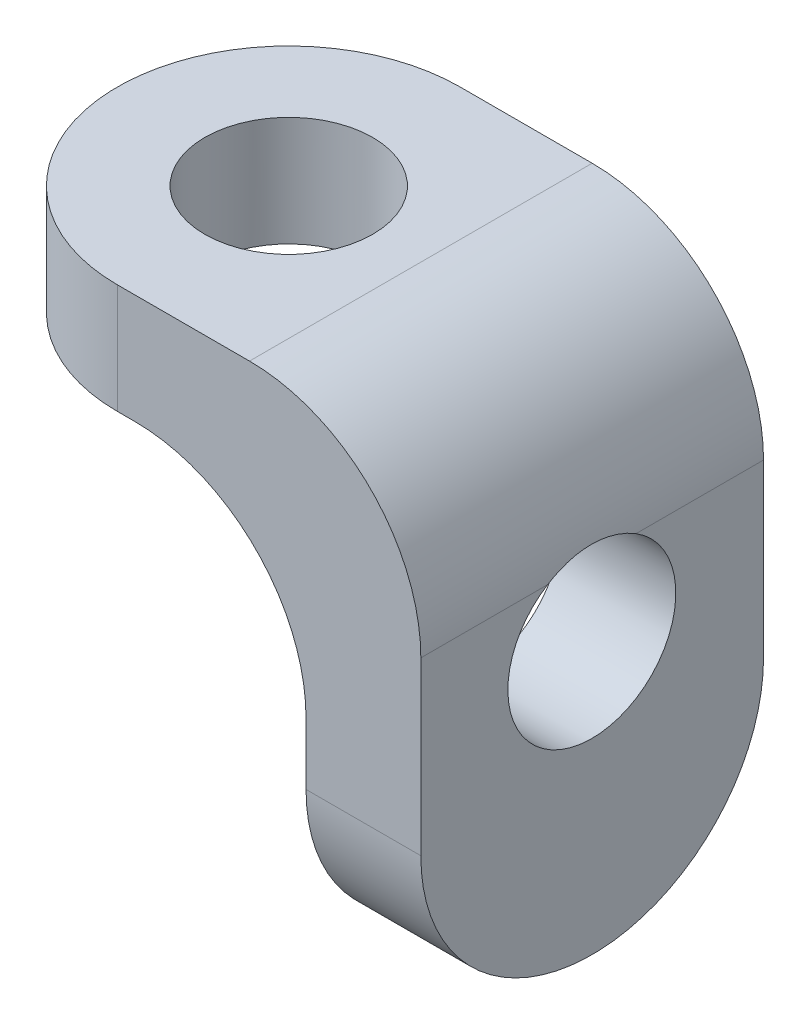
ISO-10303-21;
HEADER;
FILE_DESCRIPTION(('STEP AP214'),'2;1');
FILE_NAME('part.step','',(''),(''),'','','');
FILE_SCHEMA(('AUTOMOTIVE_DESIGN { 1 0 10303 214 1 1 1 1 }'));
ENDSEC;
DATA;
#1=APPLICATION_CONTEXT('core data for automotive mechanical design processes');
#2=APPLICATION_PROTOCOL_DEFINITION('international standard','automotive_design',2000,#1);
#3=PRODUCT_CONTEXT('',#1,'mechanical');
#4=PRODUCT('Part','Part','',(#3));
#5=PRODUCT_RELATED_PRODUCT_CATEGORY('part','',(#4));
#6=PRODUCT_DEFINITION_FORMATION('','',#4);
#7=PRODUCT_DEFINITION_CONTEXT('part definition',#1,'design');
#8=PRODUCT_DEFINITION('design','',#6,#7);
#9=PRODUCT_DEFINITION_SHAPE('','',#8);
#10=(LENGTH_UNIT() NAMED_UNIT(*) SI_UNIT(.MILLI.,.METRE.));
#11=(NAMED_UNIT(*) PLANE_ANGLE_UNIT() SI_UNIT($,.RADIAN.));
#12=(NAMED_UNIT(*) SI_UNIT($,.STERADIAN.) SOLID_ANGLE_UNIT());
#13=UNCERTAINTY_MEASURE_WITH_UNIT(LENGTH_MEASURE(1.E-05),#10,'distance_accuracy_value','');
#14=(GEOMETRIC_REPRESENTATION_CONTEXT(3) GLOBAL_UNCERTAINTY_ASSIGNED_CONTEXT((#13)) GLOBAL_UNIT_ASSIGNED_CONTEXT((#10,
#11,#12)) REPRESENTATION_CONTEXT('',''));
#15=CARTESIAN_POINT('',(0.,0.,0.));
#16=DIRECTION('',(0.,0.,1.));
#17=DIRECTION('',(1.,0.,0.));
#18=AXIS2_PLACEMENT_3D('',#15,#16,#17);
#19=CARTESIAN_POINT('',(158.280994049728,78.346819106948,-66.7483953836197));
#20=DIRECTION('',(0.,-1.,0.));
#21=DIRECTION('',(0.,0.,1.));
#22=AXIS2_PLACEMENT_3D('',#19,#20,#21);
#23=PLANE('',#22);
#24=DIRECTION('',(-1.,0.,0.));
#25=VECTOR('',#24,1.);
#26=CARTESIAN_POINT('',(158.280994049728,78.346819106948,-71.7483953836197));
#27=LINE('',#26,#25);
#28=CARTESIAN_POINT('',(158.786005082726,78.346819106948,-71.7483953836197));
#29=VERTEX_POINT('',#28);
#30=CARTESIAN_POINT('',(158.280994049728,78.346819106948,-71.7483953836197));
#31=VERTEX_POINT('',#30);
#32=EDGE_CURVE('E11',#29,#31,#27,.T.);
#33=ORIENTED_EDGE('',*,*,#32,.F.);
#34=DIRECTION('',(0.,0.,-1.));
#35=VECTOR('',#34,1.);
#36=CARTESIAN_POINT('',(158.786005082726,78.346819106948,-61.7483953836197));
#37=LINE('',#36,#35);
#38=CARTESIAN_POINT('',(158.786005082726,78.346819106948,-69.145782264486));
#39=VERTEX_POINT('',#38);
#40=EDGE_CURVE('E24',#29,#39,#37,.F.);
#41=ORIENTED_EDGE('',*,*,#40,.T.);
#42=CARTESIAN_POINT('',(158.280994049728,78.346819106948,-66.7483953836197));
#43=DIRECTION('',(0.,-1.,0.));
#44=DIRECTION('',(0.,0.,-1.));
#45=AXIS2_PLACEMENT_3D('',#42,#43,#44);
#46=CIRCLE('',#45,2.45);
#47=CARTESIAN_POINT('',(158.786005082726,78.346819106948,-64.3510085027534));
#48=VERTEX_POINT('',#47);
#49=EDGE_CURVE('E230',#48,#39,#46,.T.);
#50=ORIENTED_EDGE('',*,*,#49,.F.);
#51=DIRECTION('',(0.,0.,-1.));
#52=VECTOR('',#51,1.);
#53=CARTESIAN_POINT('',(158.786005082726,78.346819106948,-61.7483953836197));
#54=LINE('',#53,#52);
#55=CARTESIAN_POINT('',(158.786005082726,78.346819106948,-61.7483953836197));
#56=VERTEX_POINT('',#55);
#57=EDGE_CURVE('E228',#48,#56,#54,.F.);
#58=ORIENTED_EDGE('',*,*,#57,.T.);
#59=DIRECTION('',(-1.,0.,0.));
#60=VECTOR('',#59,1.);
#61=CARTESIAN_POINT('',(158.280994049728,78.346819106948,-61.7483953836197));
#62=LINE('',#61,#60);
#63=CARTESIAN_POINT('',(158.280994049728,78.346819106948,-61.7483953836197));
#64=VERTEX_POINT('',#63);
#65=EDGE_CURVE('E225',#56,#64,#62,.T.);
#66=ORIENTED_EDGE('',*,*,#65,.T.);
#67=CARTESIAN_POINT('',(158.280994049728,78.346819106948,-66.7483953836197));
#68=DIRECTION('',(0.,-1.,0.));
#69=DIRECTION('',(0.,0.,-1.));
#70=AXIS2_PLACEMENT_3D('',#67,#68,#69);
#71=CIRCLE('',#70,5.);
#72=EDGE_CURVE('E202',#64,#31,#71,.T.);
#73=ORIENTED_EDGE('',*,*,#72,.T.);
#74=EDGE_LOOP('',(#33,#41,#50,#58,#66,#73));
#75=FACE_BOUND('',#74,.T.);
#76=ADVANCED_FACE('F16',(#75),#23,.T.);
#77=CARTESIAN_POINT('',(167.136005082726,78.344819106948,-66.7483953836197));
#78=DIRECTION('',(1.,0.,0.));
#79=DIRECTION('',(0.,0.,-1.));
#80=AXIS2_PLACEMENT_3D('',#77,#78,#79);
#81=PLANE('',#80);
#82=DIRECTION('',(0.,1.,0.));
#83=VECTOR('',#82,1.);
#84=CARTESIAN_POINT('',(167.136005082726,78.344819106948,-71.7483953836197));
#85=LINE('',#84,#83);
#86=CARTESIAN_POINT('',(167.136005082726,71.546819106948,-71.7483953836197));
#87=VERTEX_POINT('',#86);
#88=CARTESIAN_POINT('',(167.136005082726,76.546819106948,-71.7483953836197));
#89=VERTEX_POINT('',#88);
#90=EDGE_CURVE('E193',#87,#89,#85,.T.);
#91=ORIENTED_EDGE('',*,*,#90,.T.);
#92=DIRECTION('',(0.,0.,-1.));
#93=VECTOR('',#92,1.);
#94=CARTESIAN_POINT('',(167.136005082726,76.546819106948,-61.7483953836197));
#95=LINE('',#94,#93);
#96=CARTESIAN_POINT('',(167.136005082726,76.546819106948,-68.0270752663484));
#97=VERTEX_POINT('',#96);
#98=EDGE_CURVE('E195',#89,#97,#95,.F.);
#99=ORIENTED_EDGE('',*,*,#98,.T.);
#100=CARTESIAN_POINT('',(167.136005082726,74.463418214921,-66.7379124670476));
#101=DIRECTION('',(1.,0.,0.));
#102=DIRECTION('',(0.,0.,-1.));
#103=AXIS2_PLACEMENT_3D('',#100,#101,#102);
#104=CIRCLE('',#103,2.45);
#105=CARTESIAN_POINT('',(167.136005082726,76.546819106948,-65.4487496677468));
#106=VERTEX_POINT('',#105);
#107=EDGE_CURVE('E215',#106,#97,#104,.T.);
#108=ORIENTED_EDGE('',*,*,#107,.F.);
#109=DIRECTION('',(0.,0.,-1.));
#110=VECTOR('',#109,1.);
#111=CARTESIAN_POINT('',(167.136005082726,76.546819106948,-61.7483953836197));
#112=LINE('',#111,#110);
#113=CARTESIAN_POINT('',(167.136005082726,76.546819106948,-61.7483953836197));
#114=VERTEX_POINT('',#113);
#115=EDGE_CURVE('E219',#106,#114,#112,.F.);
#116=ORIENTED_EDGE('',*,*,#115,.T.);
#117=DIRECTION('',(0.,1.,0.));
#118=VECTOR('',#117,1.);
#119=CARTESIAN_POINT('',(167.136005082726,78.344819106948,-61.7483953836197));
#120=LINE('',#119,#118);
#121=CARTESIAN_POINT('',(167.136005082726,71.546819106948,-61.7483953836197));
#122=VERTEX_POINT('',#121);
#123=EDGE_CURVE('E239',#122,#114,#120,.T.);
#124=ORIENTED_EDGE('',*,*,#123,.F.);
#125=CARTESIAN_POINT('',(167.136005082726,71.546819106948,-66.7483953836197));
#126=DIRECTION('',(1.,0.,0.));
#127=DIRECTION('',(0.,0.,-1.));
#128=AXIS2_PLACEMENT_3D('',#125,#126,#127);
#129=CIRCLE('',#128,5.);
#130=EDGE_CURVE('E198',#122,#87,#129,.T.);
#131=ORIENTED_EDGE('',*,*,#130,.T.);
#132=EDGE_LOOP('',(#91,#99,#108,#116,#124,#131));
#133=FACE_BOUND('',#132,.T.);
#134=ADVANCED_FACE('F185',(#133),#81,.T.);
#135=CARTESIAN_POINT('',(158.483499566228,81.546819106948,-66.7379124670476));
#136=DIRECTION('',(0.,-1.,0.));
#137=DIRECTION('',(1.,0.,0.));
#138=AXIS2_PLACEMENT_3D('',#135,#136,#137);
#139=PLANE('',#138);
#140=DIRECTION('',(-1.,0.,0.));
#141=VECTOR('',#140,1.);
#142=CARTESIAN_POINT('',(158.280994049728,81.546819106948,-61.7483953836197));
#143=LINE('',#142,#141);
#144=CARTESIAN_POINT('',(162.136005082726,81.546819106948,-61.7483953836197));
#145=VERTEX_POINT('',#144);
#146=CARTESIAN_POINT('',(158.280994049728,81.546819106948,-61.7483953836197));
#147=VERTEX_POINT('',#146);
#148=EDGE_CURVE('E244',#145,#147,#143,.T.);
#149=ORIENTED_EDGE('',*,*,#148,.F.);
#150=DIRECTION('',(0.,0.,-1.));
#151=VECTOR('',#150,1.);
#152=CARTESIAN_POINT('',(162.136005082726,81.546819106948,-71.7483953836197));
#153=LINE('',#152,#151);
#154=CARTESIAN_POINT('',(162.136005082726,81.546819106948,-71.7483953836197));
#155=VERTEX_POINT('',#154);
#156=EDGE_CURVE('E243',#145,#155,#153,.T.);
#157=ORIENTED_EDGE('',*,*,#156,.T.);
#158=DIRECTION('',(-1.,0.,0.));
#159=VECTOR('',#158,1.);
#160=CARTESIAN_POINT('',(158.280994049728,81.546819106948,-71.7483953836197));
#161=LINE('',#160,#159);
#162=CARTESIAN_POINT('',(158.280994049728,81.546819106948,-71.7483953836197));
#163=VERTEX_POINT('',#162);
#164=EDGE_CURVE('E207',#155,#163,#161,.T.);
#165=ORIENTED_EDGE('',*,*,#164,.T.);
#166=CARTESIAN_POINT('',(158.280994049728,81.546819106948,-66.7483953836197));
#167=DIRECTION('',(0.,-1.,0.));
#168=DIRECTION('',(0.,0.,-1.));
#169=AXIS2_PLACEMENT_3D('',#166,#167,#168);
#170=CIRCLE('',#169,5.);
#171=EDGE_CURVE('E238',#163,#147,#170,.F.);
#172=ORIENTED_EDGE('',*,*,#171,.T.);
#173=EDGE_LOOP('',(#149,#157,#165,#172));
#174=FACE_BOUND('',#173,.T.);
#175=CARTESIAN_POINT('',(158.280994049728,81.546819106948,-66.7483953836197));
#176=DIRECTION('',(0.,-1.,0.));
#177=DIRECTION('',(0.,0.,1.));
#178=AXIS2_PLACEMENT_3D('',#175,#176,#177);
#179=CIRCLE('',#178,2.45);
#180=CARTESIAN_POINT('',(158.280994049728,81.546819106948,-64.2983953836197));
#181=VERTEX_POINT('',#180);
#182=EDGE_CURVE('E173',#181,#181,#179,.T.);
#183=ORIENTED_EDGE('',*,*,#182,.T.);
#184=EDGE_LOOP('',(#183));
#185=FACE_BOUND('',#184,.T.);
#186=ADVANCED_FACE('F182',(#174,#185),#139,.F.);
#187=CARTESIAN_POINT('',(158.280994049728,78.344819106948,-66.7483953836197));
#188=DIRECTION('',(0.,1.,0.));
#189=DIRECTION('',(0.,0.,1.));
#190=AXIS2_PLACEMENT_3D('',#187,#188,#189);
#191=CYLINDRICAL_SURFACE('',#190,2.45);
#192=ORIENTED_EDGE('',*,*,#182,.F.);
#193=EDGE_LOOP('',(#192));
#194=FACE_BOUND('',#193,.T.);
#195=ORIENTED_EDGE('',*,*,#49,.T.);
#196=CARTESIAN_POINT('',(158.786005082726,78.346819106948,-69.145782264486));
#197=CARTESIAN_POINT('',(158.85084909492,78.3468294045806,-69.13213289009));
#198=CARTESIAN_POINT('',(158.915123176619,78.3455579560753,-69.1158363637949));
#199=CARTESIAN_POINT('',(159.042030966357,78.3406607126003,-69.0781356565447));
#200=CARTESIAN_POINT('',(159.104665461759,78.3370360700917,-69.0567339790474));
#201=CARTESIAN_POINT('',(159.227613650574,78.3276598177814,-69.0090905789647));
#202=CARTESIAN_POINT('',(159.287935563372,78.3219167008652,-68.9828683893737));
#203=CARTESIAN_POINT('',(159.406104493961,78.3085745824442,-68.9257649011121));
#204=CARTESIAN_POINT('',(159.463951273666,78.3009754028719,-68.8948831555202));
#205=CARTESIAN_POINT('',(159.633046009248,78.2758609010276,-68.795705802759));
#206=CARTESIAN_POINT('',(159.740144413726,78.2560035726438,-68.7207625434884));
#207=CARTESIAN_POINT('',(159.940724816489,78.212741471602,-68.5552583819813));
#208=CARTESIAN_POINT('',(160.034192047031,78.1893329067839,-68.4646807703063));
#209=CARTESIAN_POINT('',(160.210293237224,78.1405857186277,-68.2646420079323));
#210=CARTESIAN_POINT('',(160.292055208475,78.1152115540189,-68.1544190522296));
#211=CARTESIAN_POINT('',(160.436278629816,78.067242228814,-67.9214341773169));
#212=CARTESIAN_POINT('',(160.498740496875,78.0446470081865,-67.7986725290756));
#213=CARTESIAN_POINT('',(160.603157225708,78.0052669064043,-67.5418165777417));
#214=CARTESIAN_POINT('',(160.644826929007,77.988563694835,-67.4075927689535));
#215=CARTESIAN_POINT('',(160.704641743398,77.964167735076,-67.1332429226863));
#216=CARTESIAN_POINT('',(160.722803448416,77.9564686313987,-66.9931211207272));
#217=CARTESIAN_POINT('',(160.734340544031,77.9516005159674,-66.721724279764));
#218=CARTESIAN_POINT('',(160.729390931582,77.9537198225032,-66.5905308330732));
#219=CARTESIAN_POINT('',(160.698716242898,77.9665383497649,-66.3310337631719));
#220=CARTESIAN_POINT('',(160.67298996669,77.9772380660592,-66.2027303073152));
#221=CARTESIAN_POINT('',(160.602508228779,78.0053278539495,-65.9550949027141));
#222=CARTESIAN_POINT('',(160.558143166094,78.0225800071943,-65.835634936244));
#223=CARTESIAN_POINT('',(160.451840348512,78.0614969211787,-65.6055934276375));
#224=CARTESIAN_POINT('',(160.389897610758,78.0831629326517,-65.4950144144635));
#225=CARTESIAN_POINT('',(160.245067503015,78.1298413652354,-65.277637191729));
#226=CARTESIAN_POINT('',(160.161024105623,78.1549816979862,-65.1716352116954));
#227=CARTESIAN_POINT('',(159.976457485705,78.2039737069364,-64.974656141628));
#228=CARTESIAN_POINT('',(159.87592337098,78.2278245174616,-64.8836890624893));
#229=CARTESIAN_POINT('',(159.65667091778,78.2717364130278,-64.7162417089278));
#230=CARTESIAN_POINT('',(159.537437328489,78.2916346795768,-64.640383577819));
#231=CARTESIAN_POINT('',(159.349776565252,78.3153361955344,-64.5426770854615));
#232=CARTESIAN_POINT('',(159.285791731889,78.3222103180861,-64.5128002452337));
#233=CARTESIAN_POINT('',(159.15531260619,78.3335900777091,-64.4586262075801));
#234=CARTESIAN_POINT('',(159.088820008698,78.3380972847444,-64.434325317691));
#235=CARTESIAN_POINT('',(158.982679603589,78.3430999442095,-64.4006758710507));
#236=CARTESIAN_POINT('',(158.943679995183,78.3444865519873,-64.389370985038));
#237=CARTESIAN_POINT('',(158.865193399791,78.3463460588848,-64.3687198484071));
#238=CARTESIAN_POINT('',(158.825707040509,78.3468200315669,-64.359371308034));
#239=CARTESIAN_POINT('',(158.786005082726,78.346819106948,-64.3510085027534));
#240=B_SPLINE_CURVE_WITH_KNOTS('',3,(#196,#197,#198,#199,#200,#201,#202,#203,#204,#205,#206,
#207,#208,#209,#210,#211,#212,#213,#214,#215,#216,#217,#218,#219,#220,#221,#222,#223,#224,#225,
#226,#227,#228,#229,#230,#231,#232,#233,#234,#235,#236,#237,#238,#239),.UNSPECIFIED.,.F.,.F.,(4,
2,2,2,2,2,2,2,2,2,2,2,2,2,2,2,2,2,2,2,2,4),(0.,0.19870894294748,0.397320642846629,
0.595144619197124,0.79298758191158,1.18772904770478,1.58289504135385,1.9996718504257,
2.41643965460321,2.83877615488205,3.26081437158282,3.65276009952241,4.04472846623216,
4.42886675209394,4.81311404111386,5.22405325989177,5.63526500718839,6.06094148510721,
6.27354883121743,6.48601497715615,6.60784760816467,6.72953683572958),.UNSPECIFIED.);
#241=EDGE_CURVE('E164',#39,#48,#240,.T.);
#242=ORIENTED_EDGE('',*,*,#241,.T.);
#243=EDGE_LOOP('',(#195,#242));
#244=FACE_BOUND('',#243,.T.);
#245=ADVANCED_FACE('F177',(#194,#244),#191,.F.);
#246=CARTESIAN_POINT('',(158.280994049728,78.344819106948,-61.7483953836197));
#247=DIRECTION('',(0.,0.,-1.));
#248=DIRECTION('',(-1.,0.,0.));
#249=AXIS2_PLACEMENT_3D('',#246,#247,#248);
#250=PLANE('',#249);
#251=ORIENTED_EDGE('',*,*,#123,.T.);
#252=CARTESIAN_POINT('',(162.136005082726,76.546819106948,-61.7483953836197));
#253=DIRECTION('',(0.,0.,-1.));
#254=DIRECTION('',(-1.,0.,0.));
#255=AXIS2_PLACEMENT_3D('',#252,#253,#254);
#256=CIRCLE('',#255,5.);
#257=EDGE_CURVE('E160',#114,#145,#256,.F.);
#258=ORIENTED_EDGE('',*,*,#257,.T.);
#259=ORIENTED_EDGE('',*,*,#148,.T.);
#260=DIRECTION('',(0.,1.,0.));
#261=VECTOR('',#260,1.);
#262=CARTESIAN_POINT('',(158.280994049728,78.346819106948,-61.7483953836197));
#263=LINE('',#262,#261);
#264=EDGE_CURVE('E156',#147,#64,#263,.F.);
#265=ORIENTED_EDGE('',*,*,#264,.T.);
#266=ORIENTED_EDGE('',*,*,#65,.F.);
#267=CARTESIAN_POINT('',(158.786005082726,73.346819106948,-61.7483953836197));
#268=DIRECTION('',(0.,0.,-1.));
#269=DIRECTION('',(-1.,0.,0.));
#270=AXIS2_PLACEMENT_3D('',#267,#268,#269);
#271=CIRCLE('',#270,5.);
#272=CARTESIAN_POINT('',(163.786005082727,73.346819106948,-61.7483953836197));
#273=VERTEX_POINT('',#272);
#274=EDGE_CURVE('E153',#56,#273,#271,.T.);
#275=ORIENTED_EDGE('',*,*,#274,.T.);
#276=DIRECTION('',(0.,1.,0.));
#277=VECTOR('',#276,1.);
#278=CARTESIAN_POINT('',(163.786005082727,66.546819106948,-61.7483953836197));
#279=LINE('',#278,#277);
#280=CARTESIAN_POINT('',(163.786005082727,71.546819106948,-61.7483953836197));
#281=VERTEX_POINT('',#280);
#282=EDGE_CURVE('E150',#281,#273,#279,.T.);
#283=ORIENTED_EDGE('',*,*,#282,.F.);
#284=DIRECTION('',(1.,0.,0.));
#285=VECTOR('',#284,1.);
#286=CARTESIAN_POINT('',(167.136005082726,71.546819106948,-61.7483953836197));
#287=LINE('',#286,#285);
#288=EDGE_CURVE('E146',#281,#122,#287,.T.);
#289=ORIENTED_EDGE('',*,*,#288,.T.);
#290=EDGE_LOOP('',(#251,#258,#259,#265,#266,#275,#283,#289));
#291=FACE_BOUND('',#290,.T.);
#292=ADVANCED_FACE('F181',(#291),#250,.F.);
#293=CARTESIAN_POINT('',(158.280994049728,78.344819106948,-71.7483953836197));
#294=DIRECTION('',(0.,0.,-1.));
#295=DIRECTION('',(-1.,0.,0.));
#296=AXIS2_PLACEMENT_3D('',#293,#294,#295);
#297=PLANE('',#296);
#298=ORIENTED_EDGE('',*,*,#164,.F.);
#299=CARTESIAN_POINT('',(162.136005082726,76.546819106948,-71.7483953836197));
#300=DIRECTION('',(0.,0.,-1.));
#301=DIRECTION('',(-1.,0.,0.));
#302=AXIS2_PLACEMENT_3D('',#299,#300,#301);
#303=CIRCLE('',#302,5.);
#304=EDGE_CURVE('E142',#155,#89,#303,.T.);
#305=ORIENTED_EDGE('',*,*,#304,.T.);
#306=ORIENTED_EDGE('',*,*,#90,.F.);
#307=DIRECTION('',(1.,0.,0.));
#308=VECTOR('',#307,1.);
#309=CARTESIAN_POINT('',(158.280994049728,71.546819106948,-71.7483953836197));
#310=LINE('',#309,#308);
#311=CARTESIAN_POINT('',(163.786005082727,71.546819106948,-71.7483953836197));
#312=VERTEX_POINT('',#311);
#313=EDGE_CURVE('E139',#87,#312,#310,.F.);
#314=ORIENTED_EDGE('',*,*,#313,.T.);
#315=DIRECTION('',(0.,1.,0.));
#316=VECTOR('',#315,1.);
#317=CARTESIAN_POINT('',(163.786005082727,66.546819106948,-71.7483953836197));
#318=LINE('',#317,#316);
#319=CARTESIAN_POINT('',(163.786005082727,73.346819106948,-71.7483953836197));
#320=VERTEX_POINT('',#319);
#321=EDGE_CURVE('E136',#312,#320,#318,.T.);
#322=ORIENTED_EDGE('',*,*,#321,.T.);
#323=CARTESIAN_POINT('',(158.786005082726,73.346819106948,-71.7483953836197));
#324=DIRECTION('',(0.,0.,-1.));
#325=DIRECTION('',(-1.,0.,0.));
#326=AXIS2_PLACEMENT_3D('',#323,#324,#325);
#327=CIRCLE('',#326,5.);
#328=EDGE_CURVE('E117',#320,#29,#327,.F.);
#329=ORIENTED_EDGE('',*,*,#328,.T.);
#330=ORIENTED_EDGE('',*,*,#32,.T.);
#331=DIRECTION('',(0.,1.,0.));
#332=VECTOR('',#331,1.);
#333=CARTESIAN_POINT('',(158.280994049728,78.344819106948,-71.7483953836197));
#334=LINE('',#333,#332);
#335=EDGE_CURVE('E130',#31,#163,#334,.T.);
#336=ORIENTED_EDGE('',*,*,#335,.T.);
#337=EDGE_LOOP('',(#298,#305,#306,#314,#322,#329,#330,#336));
#338=FACE_BOUND('',#337,.T.);
#339=ADVANCED_FACE('F206',(#338),#297,.T.);
#340=CARTESIAN_POINT('',(163.786005082727,66.546819106948,-63.0181539253337));
#341=DIRECTION('',(-1.,0.,0.));
#342=DIRECTION('',(0.,0.,1.));
#343=AXIS2_PLACEMENT_3D('',#340,#341,#342);
#344=PLANE('',#343);
#345=ORIENTED_EDGE('',*,*,#282,.T.);
#346=DIRECTION('',(0.,0.,-1.));
#347=VECTOR('',#346,1.);
#348=CARTESIAN_POINT('',(163.786005082727,73.346819106948,-71.7483953836197));
#349=LINE('',#348,#347);
#350=CARTESIAN_POINT('',(163.786005082727,73.346819106948,-64.557154242926));
#351=VERTEX_POINT('',#350);
#352=EDGE_CURVE('E104',#273,#351,#349,.T.);
#353=ORIENTED_EDGE('',*,*,#352,.T.);
#354=CARTESIAN_POINT('',(163.786005082727,74.463418214921,-66.7379124670476));
#355=DIRECTION('',(-1.,0.,0.));
#356=DIRECTION('',(0.,0.,1.));
#357=AXIS2_PLACEMENT_3D('',#354,#355,#356);
#358=CIRCLE('',#357,2.45);
#359=CARTESIAN_POINT('',(163.786005082727,73.346819106948,-68.9186706911692));
#360=VERTEX_POINT('',#359);
#361=EDGE_CURVE('E95',#360,#351,#358,.T.);
#362=ORIENTED_EDGE('',*,*,#361,.F.);
#363=DIRECTION('',(0.,0.,-1.));
#364=VECTOR('',#363,1.);
#365=CARTESIAN_POINT('',(163.786005082727,73.346819106948,-71.7483953836197));
#366=LINE('',#365,#364);
#367=EDGE_CURVE('E101',#360,#320,#366,.T.);
#368=ORIENTED_EDGE('',*,*,#367,.T.);
#369=ORIENTED_EDGE('',*,*,#321,.F.);
#370=CARTESIAN_POINT('',(163.786005082727,71.546819106948,-66.7483953836197));
#371=DIRECTION('',(-1.,0.,0.));
#372=DIRECTION('',(0.,0.,1.));
#373=AXIS2_PLACEMENT_3D('',#370,#371,#372);
#374=CIRCLE('',#373,5.);
#375=EDGE_CURVE('E119',#312,#281,#374,.T.);
#376=ORIENTED_EDGE('',*,*,#375,.T.);
#377=EDGE_LOOP('',(#345,#353,#362,#368,#369,#376));
#378=FACE_BOUND('',#377,.T.);
#379=ADVANCED_FACE('F98',(#378),#344,.T.);
#380=CARTESIAN_POINT('',(188.786005082726,74.463418214921,-66.7379124670476));
#381=DIRECTION('',(-1.,0.,0.));
#382=DIRECTION('',(0.,0.,1.));
#383=AXIS2_PLACEMENT_3D('',#380,#381,#382);
#384=CYLINDRICAL_SURFACE('',#383,2.45);
#385=ORIENTED_EDGE('',*,*,#107,.T.);
#386=CARTESIAN_POINT('',(167.136005082726,76.546819106948,-68.0270752663484));
#387=CARTESIAN_POINT('',(167.135999502455,76.5830691001954,-67.9685045498232));
#388=CARTESIAN_POINT('',(167.135610606791,76.6168348141299,-67.9084032208605));
#389=CARTESIAN_POINT('',(167.134351417096,76.6791858161833,-67.7855807299759));
#390=CARTESIAN_POINT('',(167.133481158074,76.7077714808523,-67.7228597588901));
#391=CARTESIAN_POINT('',(167.131545240164,76.7595331275047,-67.5952867333587));
#392=CARTESIAN_POINT('',(167.130479753428,76.7827138349991,-67.5304365974541));
#393=CARTESIAN_POINT('',(167.128383225896,76.823536196701,-67.3990349039442));
#394=CARTESIAN_POINT('',(167.127352184803,76.8411778986701,-67.3324833610152));
#395=CARTESIAN_POINT('',(167.124608597041,76.8855952113226,-67.1309132044977));
#396=CARTESIAN_POINT('',(167.1232441606,76.9038900272335,-66.993912353141));
#397=CARTESIAN_POINT('',(167.122270430763,76.9172160301985,-66.7188193567782));
#398=CARTESIAN_POINT('',(167.122661439359,76.9122432144801,-66.5807270280828));
#399=CARTESIAN_POINT('',(167.1249702329,76.8792313394538,-66.307479042411));
#400=CARTESIAN_POINT('',(167.126886632192,76.8512132135742,-66.1723208345141));
#401=CARTESIAN_POINT('',(167.131042291277,76.7729215671223,-65.9087323155089));
#402=CARTESIAN_POINT('',(167.133281068447,76.7226810862371,-65.7802923317395));
#403=CARTESIAN_POINT('',(167.135078704006,76.6446072083736,-65.6214430447695));
#404=CARTESIAN_POINT('',(167.135411544124,76.6262099074182,-65.5862111392075));
#405=CARTESIAN_POINT('',(167.135874672398,76.5877547614103,-65.5167396972731));
#406=CARTESIAN_POINT('',(167.136005292113,76.5676996914289,-65.4824986270046));
#407=CARTESIAN_POINT('',(167.136005082726,76.546819106948,-65.4487496677468));
#408=B_SPLINE_CURVE_WITH_KNOTS('',3,(#386,#387,#388,#389,#390,#391,#392,#393,#394,#395,#396,
#397,#398,#399,#400,#401,#402,#403,#404,#405,#406,#407),.UNSPECIFIED.,.F.,.F.,(4,2,2,2,2,2,2,2,
2,2,4),(0.,0.206571379320432,0.413127736446769,0.619502820112423,0.825876124204954,
1.23840951020909,1.65101386768446,2.06324384540786,2.47486297848207,2.59407361671439,
2.71308859036125),.UNSPECIFIED.);
#409=EDGE_CURVE('E113',#97,#106,#408,.T.);
#410=ORIENTED_EDGE('',*,*,#409,.T.);
#411=EDGE_LOOP('',(#385,#410));
#412=FACE_BOUND('',#411,.T.);
#413=ORIENTED_EDGE('',*,*,#361,.T.);
#414=CARTESIAN_POINT('',(163.786005082727,73.346819106948,-64.557154242926));
#415=CARTESIAN_POINT('',(163.786012859319,73.4032156030696,-64.528267818493));
#416=CARTESIAN_POINT('',(163.785051073661,73.4607430839258,-64.501584025385));
#417=CARTESIAN_POINT('',(163.781015262279,73.5776287411692,-64.4527697503659));
#418=CARTESIAN_POINT('',(163.777941151423,73.6369869912505,-64.430639452023));
#419=CARTESIAN_POINT('',(163.769518624418,73.7569405118408,-64.3911345318705));
#420=CARTESIAN_POINT('',(163.764176204803,73.8175321225721,-64.3737475681669));
#421=CARTESIAN_POINT('',(163.751120995168,73.9396111209684,-64.3437354436726));
#422=CARTESIAN_POINT('',(163.743408358171,74.0010984505613,-64.331109975595));
#423=CARTESIAN_POINT('',(163.716596322203,74.1863210421767,-64.3004258841472));
#424=CARTESIAN_POINT('',(163.693823091987,74.3108124905587,-64.289561014812));
#425=CARTESIAN_POINT('',(163.638796387741,74.5577983259767,-64.2866098718225));
#426=CARTESIAN_POINT('',(163.606542074918,74.680292535304,-64.2945252601005));
#427=CARTESIAN_POINT('',(163.53307313777,74.9221147160307,-64.3280937738447));
#428=CARTESIAN_POINT('',(163.491727767651,75.0413645222534,-64.3540190758617));
#429=CARTESIAN_POINT('',(163.402048003046,75.2723131985363,-64.4221599934174));
#430=CARTESIAN_POINT('',(163.353710327444,75.3840084873526,-64.4643832723307));
#431=CARTESIAN_POINT('',(163.245897785777,75.6111033321463,-64.5693207436354));
#432=CARTESIAN_POINT('',(163.185782475889,75.7253411750142,-64.6338848491317));
#433=CARTESIAN_POINT('',(163.062171209461,75.941023064084,-64.7793070171508));
#434=CARTESIAN_POINT('',(162.998671119393,76.0424509328693,-64.8601853544705));
#435=CARTESIAN_POINT('',(162.862261620146,76.2452945191292,-65.0498773105542));
#436=CARTESIAN_POINT('',(162.789343779545,76.344508439649,-65.1610508588865));
#437=CARTESIAN_POINT('',(162.649570953117,76.5226063172899,-65.4020079005641));
#438=CARTESIAN_POINT('',(162.582708816615,76.6015144601097,-65.5317689651971));
#439=CARTESIAN_POINT('',(162.481992237708,76.7148367543365,-65.7658758555642));
#440=CARTESIAN_POINT('',(162.444339415537,76.755456440997,-65.8655749403578));
#441=CARTESIAN_POINT('',(162.37942385607,76.8238245802338,-66.0724725623954));
#442=CARTESIAN_POINT('',(162.352144365624,76.8515938024563,-66.1796586736174));
#443=CARTESIAN_POINT('',(162.311275137735,76.8927120714945,-66.4006279490025));
#444=CARTESIAN_POINT('',(162.297830830768,76.9059080329397,-66.5144681618839));
#445=CARTESIAN_POINT('',(162.287489628369,76.916087544182,-66.743602409701));
#446=CARTESIAN_POINT('',(162.290580882199,76.913082704788,-66.8588953443919));
#447=CARTESIAN_POINT('',(162.31109836517,76.892782349713,-67.0700633078651));
#448=CARTESIAN_POINT('',(162.326422039807,76.8775813345391,-67.1663668237472));
#449=CARTESIAN_POINT('',(162.366910744611,76.836510151929,-67.3545365990487));
#450=CARTESIAN_POINT('',(162.392085629994,76.8106292988948,-67.446398311135));
#451=CARTESIAN_POINT('',(162.461898887154,76.7367038296481,-67.6611519034949));
#452=CARTESIAN_POINT('',(162.510281466861,76.6839199583357,-67.7811852056835));
#453=CARTESIAN_POINT('',(162.61586372656,76.5622020626951,-68.0084617148216));
#454=CARTESIAN_POINT('',(162.673077886441,76.4932414173283,-68.1156833947535));
#455=CARTESIAN_POINT('',(162.792997885541,76.3391046114806,-68.319365004819));
#456=CARTESIAN_POINT('',(162.855804760762,76.2535685685941,-68.4154919079087));
#457=CARTESIAN_POINT('',(162.981698776953,76.068712406912,-68.5931727268296));
#458=CARTESIAN_POINT('',(163.044785995726,75.9693881958835,-68.6747222997115));
#459=CARTESIAN_POINT('',(163.179695140316,75.7377566201334,-68.8360077722479));
#460=CARTESIAN_POINT('',(163.250914694734,75.6027633067216,-68.9124885195543));
#461=CARTESIAN_POINT('',(163.350787915164,75.3886357311586,-69.0078448260782));
#462=CARTESIAN_POINT('',(163.382929410387,75.3152932722662,-69.0364092274202));
#463=CARTESIAN_POINT('',(163.444358849693,75.1651414005283,-69.0866011466629));
#464=CARTESIAN_POINT('',(163.473648738868,75.0883344039325,-69.1082334164058));
#465=CARTESIAN_POINT('',(163.526499456824,74.9385098187659,-69.1425291473782));
#466=CARTESIAN_POINT('',(163.550335880149,74.8657281229742,-69.155800405233));
#467=CARTESIAN_POINT('',(163.594832378927,74.7183502168517,-69.1757462133324));
#468=CARTESIAN_POINT('',(163.615494423974,74.6437551652006,-69.1824248681351));
#469=CARTESIAN_POINT('',(163.653377084518,74.4934214859377,-69.1888833916273));
#470=CARTESIAN_POINT('',(163.670598811696,74.4176832362677,-69.1886654924654));
#471=CARTESIAN_POINT('',(163.701424463356,74.2658652914477,-69.1811160210895));
#472=CARTESIAN_POINT('',(163.715030642158,74.1897858392769,-69.1737888948521));
#473=CARTESIAN_POINT('',(163.737061335188,74.0478991521776,-69.1533417963722));
#474=CARTESIAN_POINT('',(163.745927994403,73.982033571897,-69.1410916331601));
#475=CARTESIAN_POINT('',(163.760931828445,73.8512371639555,-69.1111455604641));
#476=CARTESIAN_POINT('',(163.767069183113,73.7863062749781,-69.0934500099224));
#477=CARTESIAN_POINT('',(163.776748388411,73.6577032257866,-69.0526237758233));
#478=CARTESIAN_POINT('',(163.780280116618,73.5940368999245,-69.0294723515834));
#479=CARTESIAN_POINT('',(163.784914040921,73.4687540076869,-68.9779454917227));
#480=CARTESIAN_POINT('',(163.786015968825,73.4071376683222,-68.9495694798019));
#481=CARTESIAN_POINT('',(163.786005082727,73.346819106948,-68.9186706911692));
#482=B_SPLINE_CURVE_WITH_KNOTS('',3,(#414,#415,#416,#417,#418,#419,#420,#421,#422,#423,#424,
#425,#426,#427,#428,#429,#430,#431,#432,#433,#434,#435,#436,#437,#438,#439,#440,#441,#442,#443,
#444,#445,#446,#447,#448,#449,#450,#451,#452,#453,#454,#455,#456,#457,#458,#459,#460,#461,#462,
#463,#464,#465,#466,#467,#468,#469,#470,#471,#472,#473,#474,#475,#476,#477,#478,#479,#480,#481),
.UNSPECIFIED.,.F.,.F.,(4,2,2,2,2,2,2,2,2,2,2,2,2,2,2,2,2,2,2,2,2,2,2,2,2,2,2,2,2,2,2,2,2,4),(0.,
0.190039575715719,0.380086811127787,0.56963473282212,0.759170419803227,1.13825557712687,
1.51737428230424,1.90235076015448,2.28750847644472,2.71884864132866,3.15072820152452,
3.6462134661113,4.14110581023919,4.48208430567065,4.82250975083719,5.16647816343802,
5.51020009313677,5.80500831783519,6.10011222772015,6.51712876863336,6.93483644067436,
7.36290819891204,7.79110727859264,8.30022727039529,8.55496107187949,8.80951988288292,
9.04235732225203,9.27504970530826,9.50766677558129,9.74013846522734,9.94260311814046,
10.1450544281008,10.348288144878,10.5515442928684),.UNSPECIFIED.);
#483=EDGE_CURVE('E109',#351,#360,#482,.T.);
#484=ORIENTED_EDGE('',*,*,#483,.T.);
#485=EDGE_LOOP('',(#413,#484));
#486=FACE_BOUND('',#485,.T.);
#487=ADVANCED_FACE('F110',(#412,#486),#384,.F.);
#488=CARTESIAN_POINT('',(158.280994049728,71.546819106948,-66.7483953836197));
#489=DIRECTION('',(-1.,0.,0.));
#490=DIRECTION('',(0.,0.,1.));
#491=AXIS2_PLACEMENT_3D('',#488,#489,#490);
#492=CYLINDRICAL_SURFACE('',#491,5.);
#493=ORIENTED_EDGE('',*,*,#288,.F.);
#494=ORIENTED_EDGE('',*,*,#375,.F.);
#495=ORIENTED_EDGE('',*,*,#313,.F.);
#496=ORIENTED_EDGE('',*,*,#130,.F.);
#497=EDGE_LOOP('',(#493,#494,#495,#496));
#498=FACE_BOUND('',#497,.T.);
#499=ADVANCED_FACE('F280',(#498),#492,.T.);
#500=CARTESIAN_POINT('',(158.280994049728,78.344819106948,-66.7483953836197));
#501=DIRECTION('',(0.,-1.,0.));
#502=DIRECTION('',(0.,0.,-1.));
#503=AXIS2_PLACEMENT_3D('',#500,#501,#502);
#504=CYLINDRICAL_SURFACE('',#503,5.);
#505=ORIENTED_EDGE('',*,*,#171,.F.);
#506=ORIENTED_EDGE('',*,*,#335,.F.);
#507=ORIENTED_EDGE('',*,*,#72,.F.);
#508=ORIENTED_EDGE('',*,*,#264,.F.);
#509=EDGE_LOOP('',(#505,#506,#507,#508));
#510=FACE_BOUND('',#509,.T.);
#511=ADVANCED_FACE('F260',(#510),#504,.T.);
#512=CARTESIAN_POINT('',(162.136005082726,76.546819106948,-66.7379124670476));
#513=DIRECTION('',(0.,0.,1.));
#514=DIRECTION('',(1.,0.,0.));
#515=AXIS2_PLACEMENT_3D('',#512,#513,#514);
#516=CYLINDRICAL_SURFACE('',#515,5.);
#517=ORIENTED_EDGE('',*,*,#409,.F.);
#518=ORIENTED_EDGE('',*,*,#98,.F.);
#519=ORIENTED_EDGE('',*,*,#304,.F.);
#520=ORIENTED_EDGE('',*,*,#156,.F.);
#521=ORIENTED_EDGE('',*,*,#257,.F.);
#522=ORIENTED_EDGE('',*,*,#115,.F.);
#523=EDGE_LOOP('',(#517,#518,#519,#520,#521,#522));
#524=FACE_BOUND('',#523,.T.);
#525=ADVANCED_FACE('F211',(#524),#516,.T.);
#526=CARTESIAN_POINT('',(158.786005082726,73.346819106948,-63.0181539253337));
#527=DIRECTION('',(0.,0.,1.));
#528=DIRECTION('',(1.,0.,0.));
#529=AXIS2_PLACEMENT_3D('',#526,#527,#528);
#530=CYLINDRICAL_SURFACE('',#529,5.);
#531=ORIENTED_EDGE('',*,*,#241,.F.);
#532=ORIENTED_EDGE('',*,*,#40,.F.);
#533=ORIENTED_EDGE('',*,*,#328,.F.);
#534=ORIENTED_EDGE('',*,*,#367,.F.);
#535=ORIENTED_EDGE('',*,*,#483,.F.);
#536=ORIENTED_EDGE('',*,*,#352,.F.);
#537=ORIENTED_EDGE('',*,*,#274,.F.);
#538=ORIENTED_EDGE('',*,*,#57,.F.);
#539=EDGE_LOOP('',(#531,#532,#533,#534,#535,#536,#537,#538));
#540=FACE_BOUND('',#539,.T.);
#541=ADVANCED_FACE('F116',(#540),#530,.F.);
#542=CLOSED_SHELL('',(#76,#134,#186,#245,#292,#339,#379,#487,#499,#511,#525,#541));
#543=MANIFOLD_SOLID_BREP('B1',#542);
#544=ADVANCED_BREP_SHAPE_REPRESENTATION('',(#18,#543),#14);
#545=SHAPE_DEFINITION_REPRESENTATION(#9,#544);
ENDSEC;
END-ISO-10303-21;
